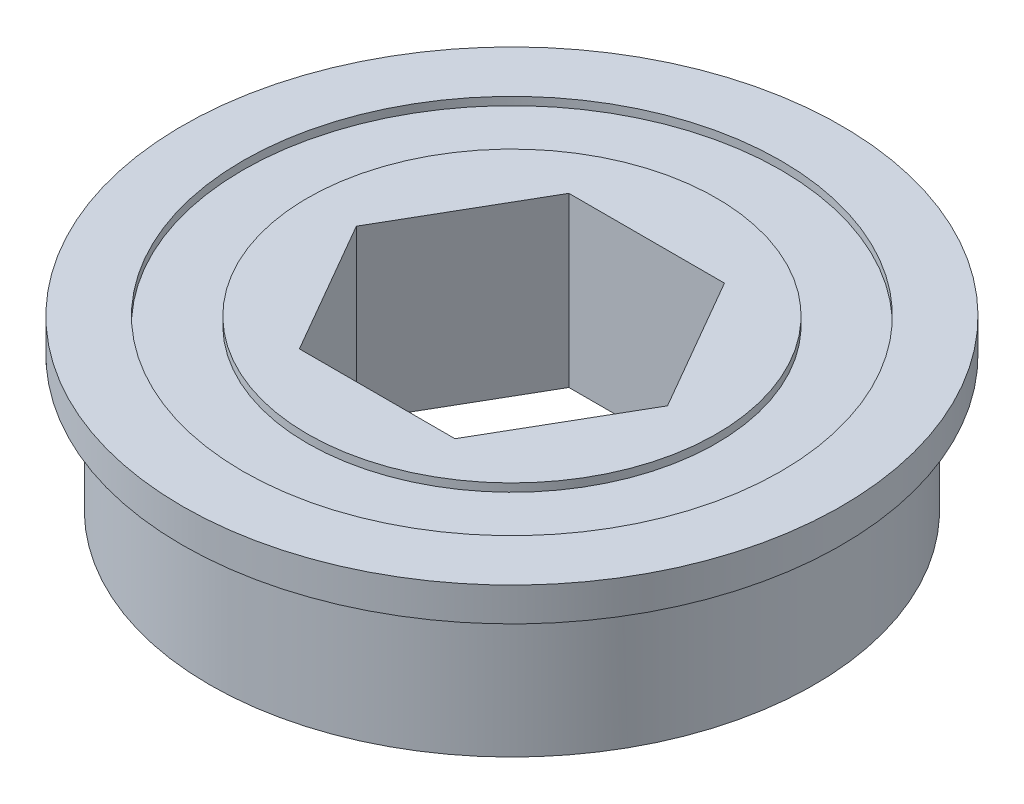
ISO-10303-21;
HEADER;
FILE_DESCRIPTION(('STEP AP214'),'2;1');
FILE_NAME('part.step','',(''),(''),'','','');
FILE_SCHEMA(('AUTOMOTIVE_DESIGN { 1 0 10303 214 1 1 1 1 }'));
ENDSEC;
DATA;
#1=APPLICATION_CONTEXT('core data for automotive mechanical design processes');
#2=APPLICATION_PROTOCOL_DEFINITION('international standard','automotive_design',2000,#1);
#3=PRODUCT_CONTEXT('',#1,'mechanical');
#4=PRODUCT('Part','Part','',(#3));
#5=PRODUCT_RELATED_PRODUCT_CATEGORY('part','',(#4));
#6=PRODUCT_DEFINITION_FORMATION('','',#4);
#7=PRODUCT_DEFINITION_CONTEXT('part definition',#1,'design');
#8=PRODUCT_DEFINITION('design','',#6,#7);
#9=PRODUCT_DEFINITION_SHAPE('','',#8);
#10=(LENGTH_UNIT() NAMED_UNIT(*) SI_UNIT(.MILLI.,.METRE.));
#11=(NAMED_UNIT(*) PLANE_ANGLE_UNIT() SI_UNIT($,.RADIAN.));
#12=(NAMED_UNIT(*) SI_UNIT($,.STERADIAN.) SOLID_ANGLE_UNIT());
#13=UNCERTAINTY_MEASURE_WITH_UNIT(LENGTH_MEASURE(1.E-05),#10,'distance_accuracy_value','');
#14=(GEOMETRIC_REPRESENTATION_CONTEXT(3) GLOBAL_UNCERTAINTY_ASSIGNED_CONTEXT((#13)) GLOBAL_UNIT_ASSIGNED_CONTEXT((#10,
#11,#12)) REPRESENTATION_CONTEXT('',''));
#15=CARTESIAN_POINT('',(0.,0.,0.));
#16=DIRECTION('',(0.,0.,1.));
#17=DIRECTION('',(1.,0.,0.));
#18=AXIS2_PLACEMENT_3D('',#15,#16,#17);
#19=CARTESIAN_POINT('',(0.,0.,0.));
#20=DIRECTION('',(0.,1.,0.));
#21=DIRECTION('',(0.,0.,1.));
#22=AXIS2_PLACEMENT_3D('',#19,#20,#21);
#23=CYLINDRICAL_SURFACE('',#22,12.7);
#24=CARTESIAN_POINT('',(0.,0.381,0.));
#25=DIRECTION('',(0.,1.,0.));
#26=DIRECTION('',(0.,0.,1.));
#27=AXIS2_PLACEMENT_3D('',#24,#25,#26);
#28=CIRCLE('',#27,12.7);
#29=CARTESIAN_POINT('',(0.,0.381,12.7));
#30=VERTEX_POINT('',#29);
#31=EDGE_CURVE('E177',#30,#30,#28,.F.);
#32=ORIENTED_EDGE('',*,*,#31,.F.);
#33=EDGE_LOOP('',(#32));
#34=FACE_BOUND('',#33,.T.);
#35=CARTESIAN_POINT('',(0.,0.,0.));
#36=DIRECTION('',(0.,1.,0.));
#37=DIRECTION('',(0.,0.,1.));
#38=AXIS2_PLACEMENT_3D('',#35,#36,#37);
#39=CIRCLE('',#38,12.7);
#40=CARTESIAN_POINT('',(0.,0.,12.7));
#41=VERTEX_POINT('',#40);
#42=EDGE_CURVE('E173',#41,#41,#39,.T.);
#43=ORIENTED_EDGE('',*,*,#42,.F.);
#44=EDGE_LOOP('',(#43));
#45=FACE_BOUND('',#44,.T.);
#46=ADVANCED_FACE('F19',(#34,#45),#23,.F.);
#47=CARTESIAN_POINT('',(9.652,0.381,0.));
#48=DIRECTION('',(0.,-1.,0.));
#49=DIRECTION('',(0.,0.,-1.));
#50=AXIS2_PLACEMENT_3D('',#47,#48,#49);
#51=PLANE('',#50);
#52=ORIENTED_EDGE('',*,*,#31,.T.);
#53=EDGE_LOOP('',(#52));
#54=FACE_BOUND('',#53,.T.);
#55=CARTESIAN_POINT('',(0.,0.381,0.));
#56=DIRECTION('',(0.,1.,0.));
#57=DIRECTION('',(0.,0.,1.));
#58=AXIS2_PLACEMENT_3D('',#55,#56,#57);
#59=CIRCLE('',#58,9.652);
#60=CARTESIAN_POINT('',(0.,0.381,9.652));
#61=VERTEX_POINT('',#60);
#62=EDGE_CURVE('E170',#61,#61,#59,.F.);
#63=ORIENTED_EDGE('',*,*,#62,.F.);
#64=EDGE_LOOP('',(#63));
#65=FACE_BOUND('',#64,.T.);
#66=ADVANCED_FACE('F261',(#54,#65),#51,.T.);
#67=CARTESIAN_POINT('',(14.2748,0.,0.));
#68=DIRECTION('',(0.,-1.,0.));
#69=DIRECTION('',(0.,0.,-1.));
#70=AXIS2_PLACEMENT_3D('',#67,#68,#69);
#71=PLANE('',#70);
#72=CARTESIAN_POINT('',(0.,0.,0.));
#73=DIRECTION('',(0.,1.,0.));
#74=DIRECTION('',(0.,0.,1.));
#75=AXIS2_PLACEMENT_3D('',#72,#73,#74);
#76=CIRCLE('',#75,14.2748);
#77=CARTESIAN_POINT('',(0.,0.,14.2748));
#78=VERTEX_POINT('',#77);
#79=EDGE_CURVE('E166',#78,#78,#76,.T.);
#80=ORIENTED_EDGE('',*,*,#79,.F.);
#81=EDGE_LOOP('',(#80));
#82=FACE_BOUND('',#81,.T.);
#83=ORIENTED_EDGE('',*,*,#42,.T.);
#84=EDGE_LOOP('',(#83));
#85=FACE_BOUND('',#84,.T.);
#86=ADVANCED_FACE('F258',(#82,#85),#71,.T.);
#87=CARTESIAN_POINT('',(0.,0.,0.));
#88=DIRECTION('',(0.,1.,0.));
#89=DIRECTION('',(0.,0.,1.));
#90=AXIS2_PLACEMENT_3D('',#87,#88,#89);
#91=CYLINDRICAL_SURFACE('',#90,9.652);
#92=CARTESIAN_POINT('',(0.,0.,0.));
#93=DIRECTION('',(0.,1.,0.));
#94=DIRECTION('',(0.,0.,1.));
#95=AXIS2_PLACEMENT_3D('',#92,#93,#94);
#96=CIRCLE('',#95,9.652);
#97=CARTESIAN_POINT('',(0.,0.,9.652));
#98=VERTEX_POINT('',#97);
#99=EDGE_CURVE('E163',#98,#98,#96,.F.);
#100=ORIENTED_EDGE('',*,*,#99,.F.);
#101=EDGE_LOOP('',(#100));
#102=FACE_BOUND('',#101,.T.);
#103=ORIENTED_EDGE('',*,*,#62,.T.);
#104=EDGE_LOOP('',(#103));
#105=FACE_BOUND('',#104,.T.);
#106=ADVANCED_FACE('F254',(#102,#105),#91,.T.);
#107=CARTESIAN_POINT('',(0.,0.,0.));
#108=DIRECTION('',(0.,1.,0.));
#109=DIRECTION('',(0.,0.,1.));
#110=AXIS2_PLACEMENT_3D('',#107,#108,#109);
#111=CYLINDRICAL_SURFACE('',#110,14.2748);
#112=ORIENTED_EDGE('',*,*,#79,.T.);
#113=EDGE_LOOP('',(#112));
#114=FACE_BOUND('',#113,.T.);
#115=CARTESIAN_POINT('',(0.,5.6,0.));
#116=DIRECTION('',(0.,-1.,0.));
#117=DIRECTION('',(0.,0.,-1.));
#118=AXIS2_PLACEMENT_3D('',#115,#116,#117);
#119=CIRCLE('',#118,14.2748);
#120=CARTESIAN_POINT('',(0.,5.6,-14.2748));
#121=VERTEX_POINT('',#120);
#122=EDGE_CURVE('E85',#121,#121,#119,.F.);
#123=ORIENTED_EDGE('',*,*,#122,.F.);
#124=EDGE_LOOP('',(#123));
#125=FACE_BOUND('',#124,.T.);
#126=ADVANCED_FACE('F250',(#114,#125),#111,.T.);
#127=CARTESIAN_POINT('',(9.652,0.,0.));
#128=DIRECTION('',(0.,-1.,0.));
#129=DIRECTION('',(0.,0.,-1.));
#130=AXIS2_PLACEMENT_3D('',#127,#128,#129);
#131=PLANE('',#130);
#132=ORIENTED_EDGE('',*,*,#99,.T.);
#133=EDGE_LOOP('',(#132));
#134=FACE_BOUND('',#133,.T.);
#135=DIRECTION('',(1.,0.,0.));
#136=VECTOR('',#135,1.);
#137=CARTESIAN_POINT('',(-3.67194771204601,0.,6.36));
#138=LINE('',#137,#136);
#139=CARTESIAN_POINT('',(-3.67194771204601,0.,6.36));
#140=VERTEX_POINT('',#139);
#141=CARTESIAN_POINT('',(3.67194771204602,0.,6.36));
#142=VERTEX_POINT('',#141);
#143=EDGE_CURVE('E64',#140,#142,#138,.T.);
#144=ORIENTED_EDGE('',*,*,#143,.T.);
#145=DIRECTION('',(0.5,0.,-0.866025403784439));
#146=VECTOR('',#145,1.);
#147=CARTESIAN_POINT('',(3.67194771204602,0.,6.36));
#148=LINE('',#147,#146);
#149=CARTESIAN_POINT('',(7.34389542409204,0.,0.));
#150=VERTEX_POINT('',#149);
#151=EDGE_CURVE('E66',#142,#150,#148,.T.);
#152=ORIENTED_EDGE('',*,*,#151,.T.);
#153=DIRECTION('',(-0.5,0.,-0.866025403784439));
#154=VECTOR('',#153,1.);
#155=CARTESIAN_POINT('',(7.34389542409204,0.,0.));
#156=LINE('',#155,#154);
#157=CARTESIAN_POINT('',(3.67194771204602,0.,-6.36));
#158=VERTEX_POINT('',#157);
#159=EDGE_CURVE('E69',#150,#158,#156,.T.);
#160=ORIENTED_EDGE('',*,*,#159,.T.);
#161=DIRECTION('',(-1.,0.,0.));
#162=VECTOR('',#161,1.);
#163=CARTESIAN_POINT('',(3.67194771204602,0.,-6.36));
#164=LINE('',#163,#162);
#165=CARTESIAN_POINT('',(-3.67194771204602,0.,-6.36));
#166=VERTEX_POINT('',#165);
#167=EDGE_CURVE('E108',#158,#166,#164,.T.);
#168=ORIENTED_EDGE('',*,*,#167,.T.);
#169=DIRECTION('',(-0.5,0.,0.866025403784439));
#170=VECTOR('',#169,1.);
#171=CARTESIAN_POINT('',(-3.67194771204602,0.,-6.36));
#172=LINE('',#171,#170);
#173=CARTESIAN_POINT('',(-7.34389542409204,0.,0.));
#174=VERTEX_POINT('',#173);
#175=EDGE_CURVE('E117',#166,#174,#172,.T.);
#176=ORIENTED_EDGE('',*,*,#175,.T.);
#177=DIRECTION('',(0.5,0.,0.866025403784439));
#178=VECTOR('',#177,1.);
#179=CARTESIAN_POINT('',(-7.34389542409204,0.,0.));
#180=LINE('',#179,#178);
#181=EDGE_CURVE('E123',#174,#140,#180,.T.);
#182=ORIENTED_EDGE('',*,*,#181,.T.);
#183=EDGE_LOOP('',(#144,#152,#160,#168,#176,#182));
#184=FACE_BOUND('',#183,.T.);
#185=ADVANCED_FACE('F68',(#134,#184),#131,.T.);
#186=CARTESIAN_POINT('',(0.,5.6,0.));
#187=DIRECTION('',(0.,-1.,0.));
#188=DIRECTION('',(0.,0.,-1.));
#189=AXIS2_PLACEMENT_3D('',#186,#187,#188);
#190=CONICAL_SURFACE('',#189,14.2748,0.523598775598298);
#191=CARTESIAN_POINT('',(0.,5.975,0.));
#192=DIRECTION('',(0.,1.,0.));
#193=DIRECTION('',(0.,0.,1.));
#194=AXIS2_PLACEMENT_3D('',#191,#192,#193);
#195=CIRCLE('',#194,14.0582936490539);
#196=CARTESIAN_POINT('',(0.,5.975,14.0582936490539));
#197=VERTEX_POINT('',#196);
#198=EDGE_CURVE('E298',#197,#197,#195,.F.);
#199=ORIENTED_EDGE('',*,*,#198,.T.);
#200=EDGE_LOOP('',(#199));
#201=FACE_BOUND('',#200,.T.);
#202=ORIENTED_EDGE('',*,*,#122,.T.);
#203=EDGE_LOOP('',(#202));
#204=FACE_BOUND('',#203,.T.);
#205=ADVANCED_FACE('F244',(#201,#204),#190,.T.);
#206=CARTESIAN_POINT('',(7.34389542409204,0.,0.));
#207=DIRECTION('',(0.866025403784439,0.,-0.5));
#208=DIRECTION('',(-0.5,0.,-0.866025403784439));
#209=AXIS2_PLACEMENT_3D('',#206,#207,#208);
#210=PLANE('',#209);
#211=DIRECTION('',(0.,1.,0.));
#212=VECTOR('',#211,1.);
#213=CARTESIAN_POINT('',(3.67194771204602,0.,-6.36));
#214=LINE('',#213,#212);
#215=CARTESIAN_POINT('',(3.67194771204602,7.9375,-6.36));
#216=VERTEX_POINT('',#215);
#217=EDGE_CURVE('E83',#216,#158,#214,.F.);
#218=ORIENTED_EDGE('',*,*,#217,.T.);
#219=ORIENTED_EDGE('',*,*,#159,.F.);
#220=DIRECTION('',(0.,1.,0.));
#221=VECTOR('',#220,1.);
#222=CARTESIAN_POINT('',(7.34389542409204,0.,0.));
#223=LINE('',#222,#221);
#224=CARTESIAN_POINT('',(7.34389542409204,7.9375,0.));
#225=VERTEX_POINT('',#224);
#226=EDGE_CURVE('E75',#150,#225,#223,.T.);
#227=ORIENTED_EDGE('',*,*,#226,.T.);
#228=DIRECTION('',(0.5,0.,0.866025403784438));
#229=VECTOR('',#228,1.);
#230=CARTESIAN_POINT('',(3.67194771204602,7.9375,-6.36));
#231=LINE('',#230,#229);
#232=EDGE_CURVE('E300',#216,#225,#231,.T.);
#233=ORIENTED_EDGE('',*,*,#232,.F.);
#234=EDGE_LOOP('',(#218,#219,#227,#233));
#235=FACE_BOUND('',#234,.T.);
#236=ADVANCED_FACE('F79',(#235),#210,.F.);
#237=CARTESIAN_POINT('',(3.67194771204602,0.,6.36));
#238=DIRECTION('',(0.866025403784439,0.,0.5));
#239=DIRECTION('',(0.5,0.,-0.866025403784439));
#240=AXIS2_PLACEMENT_3D('',#237,#238,#239);
#241=PLANE('',#240);
#242=ORIENTED_EDGE('',*,*,#226,.F.);
#243=ORIENTED_EDGE('',*,*,#151,.F.);
#244=DIRECTION('',(0.,1.,0.));
#245=VECTOR('',#244,1.);
#246=CARTESIAN_POINT('',(3.67194771204602,0.,6.36));
#247=LINE('',#246,#245);
#248=CARTESIAN_POINT('',(3.67194771204602,7.9375,6.36));
#249=VERTEX_POINT('',#248);
#250=EDGE_CURVE('E92',#142,#249,#247,.T.);
#251=ORIENTED_EDGE('',*,*,#250,.T.);
#252=DIRECTION('',(-0.5,0.,0.866025403784439));
#253=VECTOR('',#252,1.);
#254=CARTESIAN_POINT('',(7.34389542409204,7.9375,0.));
#255=LINE('',#254,#253);
#256=EDGE_CURVE('E89',#225,#249,#255,.T.);
#257=ORIENTED_EDGE('',*,*,#256,.F.);
#258=EDGE_LOOP('',(#242,#243,#251,#257));
#259=FACE_BOUND('',#258,.T.);
#260=ADVANCED_FACE('F87',(#259),#241,.F.);
#261=CARTESIAN_POINT('',(-3.67194771204601,0.,6.36));
#262=DIRECTION('',(0.,0.,1.));
#263=DIRECTION('',(1.,0.,0.));
#264=AXIS2_PLACEMENT_3D('',#261,#262,#263);
#265=PLANE('',#264);
#266=ORIENTED_EDGE('',*,*,#250,.F.);
#267=ORIENTED_EDGE('',*,*,#143,.F.);
#268=DIRECTION('',(0.,1.,0.));
#269=VECTOR('',#268,1.);
#270=CARTESIAN_POINT('',(-3.67194771204601,0.,6.36));
#271=LINE('',#270,#269);
#272=CARTESIAN_POINT('',(-3.67194771204601,7.9375,6.36));
#273=VERTEX_POINT('',#272);
#274=EDGE_CURVE('E120',#140,#273,#271,.T.);
#275=ORIENTED_EDGE('',*,*,#274,.T.);
#276=DIRECTION('',(1.,0.,0.));
#277=VECTOR('',#276,1.);
#278=CARTESIAN_POINT('',(6.35,7.9375,6.36));
#279=LINE('',#278,#277);
#280=EDGE_CURVE('E141',#249,#273,#279,.F.);
#281=ORIENTED_EDGE('',*,*,#280,.F.);
#282=EDGE_LOOP('',(#266,#267,#275,#281));
#283=FACE_BOUND('',#282,.T.);
#284=ADVANCED_FACE('F235',(#283),#265,.F.);
#285=CARTESIAN_POINT('',(-7.34389542409204,0.,0.));
#286=DIRECTION('',(-0.866025403784439,0.,0.5));
#287=DIRECTION('',(0.5,0.,0.866025403784439));
#288=AXIS2_PLACEMENT_3D('',#285,#286,#287);
#289=PLANE('',#288);
#290=ORIENTED_EDGE('',*,*,#274,.F.);
#291=ORIENTED_EDGE('',*,*,#181,.F.);
#292=DIRECTION('',(0.,1.,0.));
#293=VECTOR('',#292,1.);
#294=CARTESIAN_POINT('',(-7.34389542409204,0.,0.));
#295=LINE('',#294,#293);
#296=CARTESIAN_POINT('',(-7.34389542409204,7.9375,0.));
#297=VERTEX_POINT('',#296);
#298=EDGE_CURVE('E115',#174,#297,#295,.T.);
#299=ORIENTED_EDGE('',*,*,#298,.T.);
#300=DIRECTION('',(-0.5,0.,-0.866025403784439));
#301=VECTOR('',#300,1.);
#302=CARTESIAN_POINT('',(-3.67194771204601,7.9375,6.36));
#303=LINE('',#302,#301);
#304=EDGE_CURVE('E135',#273,#297,#303,.T.);
#305=ORIENTED_EDGE('',*,*,#304,.F.);
#306=EDGE_LOOP('',(#290,#291,#299,#305));
#307=FACE_BOUND('',#306,.T.);
#308=ADVANCED_FACE('F231',(#307),#289,.F.);
#309=CARTESIAN_POINT('',(-3.67194771204602,0.,-6.36));
#310=DIRECTION('',(-0.866025403784439,0.,-0.5));
#311=DIRECTION('',(-0.5,0.,0.866025403784439));
#312=AXIS2_PLACEMENT_3D('',#309,#310,#311);
#313=PLANE('',#312);
#314=ORIENTED_EDGE('',*,*,#298,.F.);
#315=ORIENTED_EDGE('',*,*,#175,.F.);
#316=DIRECTION('',(0.,1.,0.));
#317=VECTOR('',#316,1.);
#318=CARTESIAN_POINT('',(-3.67194771204602,0.,-6.36));
#319=LINE('',#318,#317);
#320=CARTESIAN_POINT('',(-3.67194771204602,7.9375,-6.36));
#321=VERTEX_POINT('',#320);
#322=EDGE_CURVE('E112',#166,#321,#319,.T.);
#323=ORIENTED_EDGE('',*,*,#322,.T.);
#324=DIRECTION('',(0.5,0.,-0.866025403784439));
#325=VECTOR('',#324,1.);
#326=CARTESIAN_POINT('',(-7.34389542409204,7.9375,0.));
#327=LINE('',#326,#325);
#328=EDGE_CURVE('E130',#297,#321,#327,.T.);
#329=ORIENTED_EDGE('',*,*,#328,.F.);
#330=EDGE_LOOP('',(#314,#315,#323,#329));
#331=FACE_BOUND('',#330,.T.);
#332=ADVANCED_FACE('F227',(#331),#313,.F.);
#333=CARTESIAN_POINT('',(3.67194771204602,0.,-6.36));
#334=DIRECTION('',(0.,0.,-1.));
#335=DIRECTION('',(-1.,0.,0.));
#336=AXIS2_PLACEMENT_3D('',#333,#334,#335);
#337=PLANE('',#336);
#338=ORIENTED_EDGE('',*,*,#322,.F.);
#339=ORIENTED_EDGE('',*,*,#167,.F.);
#340=ORIENTED_EDGE('',*,*,#217,.F.);
#341=DIRECTION('',(1.,0.,0.));
#342=VECTOR('',#341,1.);
#343=CARTESIAN_POINT('',(6.35,7.9375,-6.36));
#344=LINE('',#343,#342);
#345=EDGE_CURVE('E134',#321,#216,#344,.T.);
#346=ORIENTED_EDGE('',*,*,#345,.F.);
#347=EDGE_LOOP('',(#338,#339,#340,#346));
#348=FACE_BOUND('',#347,.T.);
#349=ADVANCED_FACE('F223',(#348),#337,.F.);
#350=CARTESIAN_POINT('',(6.35,7.9375,0.));
#351=DIRECTION('',(0.,1.,0.));
#352=DIRECTION('',(0.,0.,1.));
#353=AXIS2_PLACEMENT_3D('',#350,#351,#352);
#354=PLANE('',#353);
#355=CARTESIAN_POINT('',(0.,7.9375,0.));
#356=DIRECTION('',(0.,1.,0.));
#357=DIRECTION('',(0.,0.,1.));
#358=AXIS2_PLACEMENT_3D('',#355,#356,#357);
#359=CIRCLE('',#358,9.652);
#360=CARTESIAN_POINT('',(0.,7.9375,9.652));
#361=VERTEX_POINT('',#360);
#362=EDGE_CURVE('E159',#361,#361,#359,.F.);
#363=ORIENTED_EDGE('',*,*,#362,.F.);
#364=EDGE_LOOP('',(#363));
#365=FACE_BOUND('',#364,.T.);
#366=ORIENTED_EDGE('',*,*,#328,.T.);
#367=ORIENTED_EDGE('',*,*,#345,.T.);
#368=ORIENTED_EDGE('',*,*,#232,.T.);
#369=ORIENTED_EDGE('',*,*,#256,.T.);
#370=ORIENTED_EDGE('',*,*,#280,.T.);
#371=ORIENTED_EDGE('',*,*,#304,.T.);
#372=EDGE_LOOP('',(#366,#367,#368,#369,#370,#371));
#373=FACE_BOUND('',#372,.T.);
#374=ADVANCED_FACE('F211',(#365,#373),#354,.T.);
#375=CARTESIAN_POINT('',(0.,6.1,0.));
#376=DIRECTION('',(0.,1.,0.));
#377=DIRECTION('',(0.,0.,1.));
#378=AXIS2_PLACEMENT_3D('',#375,#376,#377);
#379=TOROIDAL_SURFACE('',#378,14.2748,0.25);
#380=ORIENTED_EDGE('',*,*,#198,.F.);
#381=EDGE_LOOP('',(#380));
#382=FACE_BOUND('',#381,.T.);
#383=CARTESIAN_POINT('',(0.,6.35,0.));
#384=DIRECTION('',(0.,-1.,0.));
#385=DIRECTION('',(0.,0.,-1.));
#386=AXIS2_PLACEMENT_3D('',#383,#384,#385);
#387=CIRCLE('',#386,14.2748);
#388=CARTESIAN_POINT('',(0.,6.35,14.2748));
#389=VERTEX_POINT('',#388);
#390=CARTESIAN_POINT('',(0.,6.35,-14.2748));
#391=VERTEX_POINT('',#390);
#392=EDGE_CURVE('E162',#389,#391,#387,.F.);
#393=ORIENTED_EDGE('',*,*,#392,.F.);
#394=CARTESIAN_POINT('',(0.,6.35,0.));
#395=DIRECTION('',(0.,-1.,0.));
#396=DIRECTION('',(0.,0.,1.));
#397=AXIS2_PLACEMENT_3D('',#394,#395,#396);
#398=CIRCLE('',#397,14.2748);
#399=EDGE_CURVE('E38',#391,#389,#398,.F.);
#400=ORIENTED_EDGE('',*,*,#399,.F.);
#401=EDGE_LOOP('',(#393,#400));
#402=FACE_BOUND('',#401,.T.);
#403=ADVANCED_FACE('F179',(#382,#402),#379,.F.);
#404=CARTESIAN_POINT('',(0.,0.,0.));
#405=DIRECTION('',(0.,1.,0.));
#406=DIRECTION('',(0.,0.,1.));
#407=AXIS2_PLACEMENT_3D('',#404,#405,#406);
#408=CYLINDRICAL_SURFACE('',#407,9.652);
#409=CARTESIAN_POINT('',(0.,7.5565,0.));
#410=DIRECTION('',(0.,1.,0.));
#411=DIRECTION('',(0.,0.,1.));
#412=AXIS2_PLACEMENT_3D('',#409,#410,#411);
#413=CIRCLE('',#412,9.652);
#414=CARTESIAN_POINT('',(0.,7.5565,9.652));
#415=VERTEX_POINT('',#414);
#416=EDGE_CURVE('E154',#415,#415,#413,.F.);
#417=ORIENTED_EDGE('',*,*,#416,.F.);
#418=EDGE_LOOP('',(#417));
#419=FACE_BOUND('',#418,.T.);
#420=ORIENTED_EDGE('',*,*,#362,.T.);
#421=EDGE_LOOP('',(#420));
#422=FACE_BOUND('',#421,.T.);
#423=ADVANCED_FACE('F202',(#419,#422),#408,.T.);
#424=CARTESIAN_POINT('',(15.5575,6.35,0.));
#425=DIRECTION('',(0.,-1.,0.));
#426=DIRECTION('',(0.,0.,-1.));
#427=AXIS2_PLACEMENT_3D('',#424,#425,#426);
#428=PLANE('',#427);
#429=CARTESIAN_POINT('',(0.,6.35,0.));
#430=DIRECTION('',(0.,1.,0.));
#431=DIRECTION('',(0.,0.,1.));
#432=AXIS2_PLACEMENT_3D('',#429,#430,#431);
#433=CIRCLE('',#432,15.5575);
#434=CARTESIAN_POINT('',(0.,6.35,15.5575));
#435=VERTEX_POINT('',#434);
#436=EDGE_CURVE('E149',#435,#435,#433,.T.);
#437=ORIENTED_EDGE('',*,*,#436,.F.);
#438=EDGE_LOOP('',(#437));
#439=FACE_BOUND('',#438,.T.);
#440=ORIENTED_EDGE('',*,*,#392,.T.);
#441=ORIENTED_EDGE('',*,*,#399,.T.);
#442=EDGE_LOOP('',(#440,#441));
#443=FACE_BOUND('',#442,.T.);
#444=ADVANCED_FACE('F183',(#439,#443),#428,.T.);
#445=CARTESIAN_POINT('',(9.652,7.5565,0.));
#446=DIRECTION('',(0.,1.,0.));
#447=DIRECTION('',(0.,0.,1.));
#448=AXIS2_PLACEMENT_3D('',#445,#446,#447);
#449=PLANE('',#448);
#450=ORIENTED_EDGE('',*,*,#416,.T.);
#451=EDGE_LOOP('',(#450));
#452=FACE_BOUND('',#451,.T.);
#453=CARTESIAN_POINT('',(0.,7.5565,0.));
#454=DIRECTION('',(0.,1.,0.));
#455=DIRECTION('',(0.,0.,1.));
#456=AXIS2_PLACEMENT_3D('',#453,#454,#455);
#457=CIRCLE('',#456,12.7);
#458=CARTESIAN_POINT('',(0.,7.5565,12.7));
#459=VERTEX_POINT('',#458);
#460=EDGE_CURVE('E153',#459,#459,#457,.T.);
#461=ORIENTED_EDGE('',*,*,#460,.T.);
#462=EDGE_LOOP('',(#461));
#463=FACE_BOUND('',#462,.T.);
#464=ADVANCED_FACE('F201',(#452,#463),#449,.T.);
#465=CARTESIAN_POINT('',(0.,0.,0.));
#466=DIRECTION('',(0.,1.,0.));
#467=DIRECTION('',(0.,0.,1.));
#468=AXIS2_PLACEMENT_3D('',#465,#466,#467);
#469=CYLINDRICAL_SURFACE('',#468,15.5575);
#470=ORIENTED_EDGE('',*,*,#436,.T.);
#471=EDGE_LOOP('',(#470));
#472=FACE_BOUND('',#471,.T.);
#473=CARTESIAN_POINT('',(0.,7.9375,0.));
#474=DIRECTION('',(0.,1.,0.));
#475=DIRECTION('',(0.,0.,1.));
#476=AXIS2_PLACEMENT_3D('',#473,#474,#475);
#477=CIRCLE('',#476,15.5575);
#478=CARTESIAN_POINT('',(0.,7.9375,15.5575));
#479=VERTEX_POINT('',#478);
#480=EDGE_CURVE('E30',#479,#479,#477,.T.);
#481=ORIENTED_EDGE('',*,*,#480,.F.);
#482=EDGE_LOOP('',(#481));
#483=FACE_BOUND('',#482,.T.);
#484=ADVANCED_FACE('F279',(#472,#483),#469,.T.);
#485=CARTESIAN_POINT('',(0.,0.,0.));
#486=DIRECTION('',(0.,1.,0.));
#487=DIRECTION('',(0.,0.,1.));
#488=AXIS2_PLACEMENT_3D('',#485,#486,#487);
#489=CYLINDRICAL_SURFACE('',#488,12.7);
#490=CARTESIAN_POINT('',(0.,7.9375,0.));
#491=DIRECTION('',(0.,1.,0.));
#492=DIRECTION('',(0.,0.,1.));
#493=AXIS2_PLACEMENT_3D('',#490,#491,#492);
#494=CIRCLE('',#493,12.7);
#495=CARTESIAN_POINT('',(0.,7.9375,12.7));
#496=VERTEX_POINT('',#495);
#497=EDGE_CURVE('E12',#496,#496,#494,.F.);
#498=ORIENTED_EDGE('',*,*,#497,.F.);
#499=EDGE_LOOP('',(#498));
#500=FACE_BOUND('',#499,.T.);
#501=ORIENTED_EDGE('',*,*,#460,.F.);
#502=EDGE_LOOP('',(#501));
#503=FACE_BOUND('',#502,.T.);
#504=ADVANCED_FACE('F273',(#500,#503),#489,.F.);
#505=CARTESIAN_POINT('',(12.7,7.9375,0.));
#506=DIRECTION('',(0.,1.,0.));
#507=DIRECTION('',(0.,0.,1.));
#508=AXIS2_PLACEMENT_3D('',#505,#506,#507);
#509=PLANE('',#508);
#510=ORIENTED_EDGE('',*,*,#497,.T.);
#511=EDGE_LOOP('',(#510));
#512=FACE_BOUND('',#511,.T.);
#513=ORIENTED_EDGE('',*,*,#480,.T.);
#514=EDGE_LOOP('',(#513));
#515=FACE_BOUND('',#514,.T.);
#516=ADVANCED_FACE('F271',(#512,#515),#509,.T.);
#517=CLOSED_SHELL('',(#46,#66,#86,#106,#126,#185,#205,#236,#260,#284,#308,#332,#349,#374,#403,
#423,#444,#464,#484,#504,#516));
#518=MANIFOLD_SOLID_BREP('B1',#517);
#519=ADVANCED_BREP_SHAPE_REPRESENTATION('',(#18,#518),#14);
#520=SHAPE_DEFINITION_REPRESENTATION(#9,#519);
ENDSEC;
END-ISO-10303-21;
